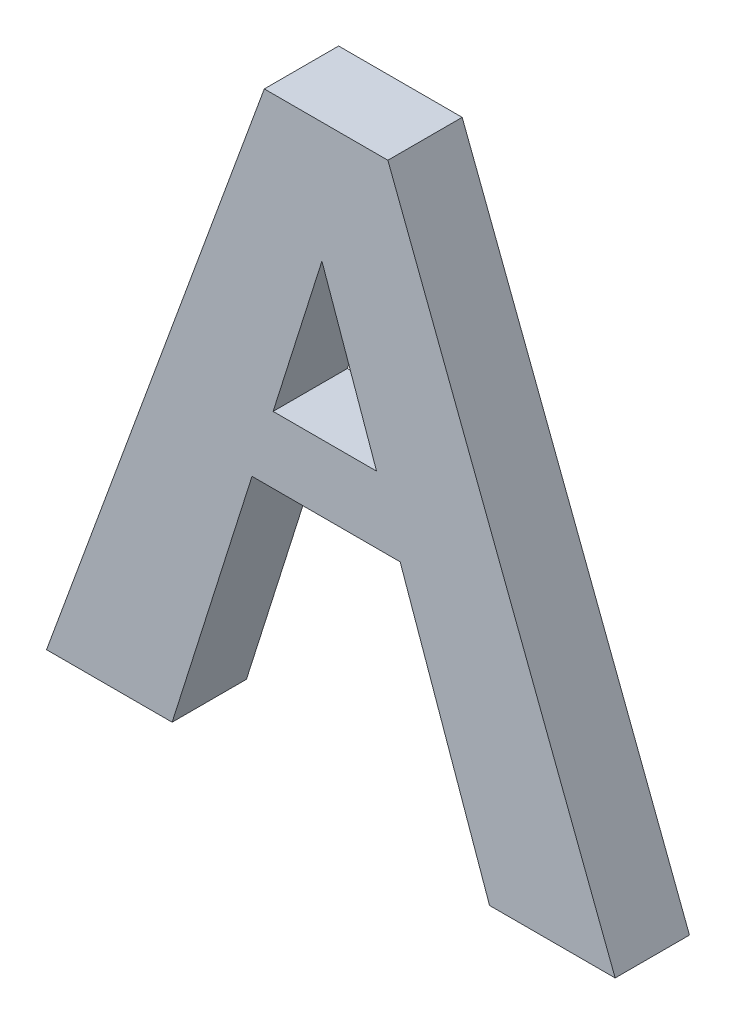
ISO-10303-21;
HEADER;
FILE_DESCRIPTION(('STEP AP214'),'2;1');
FILE_NAME('part.step','',(''),(''),'','','');
FILE_SCHEMA(('AUTOMOTIVE_DESIGN { 1 0 10303 214 1 1 1 1 }'));
ENDSEC;
DATA;
#1=APPLICATION_CONTEXT('core data for automotive mechanical design processes');
#2=APPLICATION_PROTOCOL_DEFINITION('international standard','automotive_design',2000,#1);
#3=PRODUCT_CONTEXT('',#1,'mechanical');
#4=PRODUCT('Part','Part','',(#3));
#5=PRODUCT_RELATED_PRODUCT_CATEGORY('part','',(#4));
#6=PRODUCT_DEFINITION_FORMATION('','',#4);
#7=PRODUCT_DEFINITION_CONTEXT('part definition',#1,'design');
#8=PRODUCT_DEFINITION('design','',#6,#7);
#9=PRODUCT_DEFINITION_SHAPE('','',#8);
#10=(LENGTH_UNIT() NAMED_UNIT(*) SI_UNIT(.MILLI.,.METRE.));
#11=(NAMED_UNIT(*) PLANE_ANGLE_UNIT() SI_UNIT($,.RADIAN.));
#12=(NAMED_UNIT(*) SI_UNIT($,.STERADIAN.) SOLID_ANGLE_UNIT());
#13=UNCERTAINTY_MEASURE_WITH_UNIT(LENGTH_MEASURE(1.E-05),#10,'distance_accuracy_value','');
#14=(GEOMETRIC_REPRESENTATION_CONTEXT(3) GLOBAL_UNCERTAINTY_ASSIGNED_CONTEXT((#13)) GLOBAL_UNIT_ASSIGNED_CONTEXT((#10,
#11,#12)) REPRESENTATION_CONTEXT('',''));
#15=CARTESIAN_POINT('',(0.,0.,0.));
#16=DIRECTION('',(0.,0.,1.));
#17=DIRECTION('',(1.,0.,0.));
#18=AXIS2_PLACEMENT_3D('',#15,#16,#17);
#19=CARTESIAN_POINT('',(0.,0.,3.175));
#20=DIRECTION('',(0.,0.,-1.));
#21=DIRECTION('',(-1.,0.,0.));
#22=AXIS2_PLACEMENT_3D('',#19,#20,#21);
#23=PLANE('',#22);
#24=DIRECTION('',(-0.343947535763865,-0.938988867155498,0.));
#25=VECTOR('',#24,1.);
#26=CARTESIAN_POINT('',(-23.8862602771177,-21.6091203636897,3.175));
#27=LINE('',#26,#25);
#28=CARTESIAN_POINT('',(-5.27844134766191,29.1908796363103,3.175));
#29=VERTEX_POINT('',#28);
#30=CARTESIAN_POINT('',(-23.8862602771177,-21.6091203636897,3.175));
#31=VERTEX_POINT('',#30);
#32=EDGE_CURVE('E143',#29,#31,#27,.T.);
#33=ORIENTED_EDGE('',*,*,#32,.T.);
#34=DIRECTION('',(1.,0.,0.));
#35=VECTOR('',#34,1.);
#36=CARTESIAN_POINT('',(-13.1540275383073,-21.6091203636897,3.175));
#37=LINE('',#36,#35);
#38=CARTESIAN_POINT('',(-13.1540275383073,-21.6091203636897,3.175));
#39=VERTEX_POINT('',#38);
#40=EDGE_CURVE('E146',#31,#39,#37,.T.);
#41=ORIENTED_EDGE('',*,*,#40,.T.);
#42=DIRECTION('',(0.301200548820613,0.95356081577955,0.));
#43=VECTOR('',#42,1.);
#44=CARTESIAN_POINT('',(-6.32837068940135,0.,3.175));
#45=LINE('',#44,#43);
#46=CARTESIAN_POINT('',(-6.32837068940135,0.,3.175));
#47=VERTEX_POINT('',#46);
#48=EDGE_CURVE('E149',#39,#47,#45,.T.);
#49=ORIENTED_EDGE('',*,*,#48,.T.);
#50=DIRECTION('',(1.,0.,0.));
#51=VECTOR('',#50,1.);
#52=CARTESIAN_POINT('',(6.32837068940135,0.,3.175));
#53=LINE('',#52,#51);
#54=CARTESIAN_POINT('',(6.32837068940135,0.,3.175));
#55=VERTEX_POINT('',#54);
#56=EDGE_CURVE('E151',#47,#55,#53,.T.);
#57=ORIENTED_EDGE('',*,*,#56,.T.);
#58=DIRECTION('',(0.333268471217784,-0.942831971292956,0.));
#59=VECTOR('',#58,1.);
#60=CARTESIAN_POINT('',(13.9666760579518,-21.6091203636897,3.175));
#61=LINE('',#60,#59);
#62=CARTESIAN_POINT('',(13.9666760579518,-21.6091203636897,3.175));
#63=VERTEX_POINT('',#62);
#64=EDGE_CURVE('E153',#55,#63,#61,.T.);
#65=ORIENTED_EDGE('',*,*,#64,.T.);
#66=DIRECTION('',(1.,0.,0.));
#67=VECTOR('',#66,1.);
#68=CARTESIAN_POINT('',(24.6989087967622,-21.6091203636897,3.175));
#69=LINE('',#68,#67);
#70=CARTESIAN_POINT('',(24.6989087967622,-21.6091203636897,3.175));
#71=VERTEX_POINT('',#70);
#72=EDGE_CURVE('E155',#63,#71,#69,.T.);
#73=ORIENTED_EDGE('',*,*,#72,.T.);
#74=DIRECTION('',(-0.357088345830901,0.934070614713765,0.));
#75=VECTOR('',#74,1.);
#76=CARTESIAN_POINT('',(5.27844134766191,29.1908796363103,3.175));
#77=LINE('',#76,#75);
#78=CARTESIAN_POINT('',(5.27844134766191,29.1908796363103,3.175));
#79=VERTEX_POINT('',#78);
#80=EDGE_CURVE('E157',#71,#79,#77,.T.);
#81=ORIENTED_EDGE('',*,*,#80,.T.);
#82=DIRECTION('',(-1.,0.,0.));
#83=VECTOR('',#82,1.);
#84=CARTESIAN_POINT('',(-5.27844134766191,29.1908796363103,3.175));
#85=LINE('',#84,#83);
#86=EDGE_CURVE('E159',#79,#29,#85,.T.);
#87=ORIENTED_EDGE('',*,*,#86,.T.);
#88=EDGE_LOOP('',(#33,#41,#49,#57,#65,#73,#81,#87));
#89=FACE_BOUND('',#88,.T.);
#90=DIRECTION('',(-0.301200548820613,-0.95356081577955,0.));
#91=VECTOR('',#90,1.);
#92=CARTESIAN_POINT('',(-4.52676469944436,5.70364457908036,3.175));
#93=LINE('',#92,#91);
#94=CARTESIAN_POINT('',(-0.355555483012587,18.9091373272916,3.175));
#95=VERTEX_POINT('',#94);
#96=CARTESIAN_POINT('',(-4.52676469944436,5.70364457908036,3.175));
#97=VERTEX_POINT('',#96);
#98=EDGE_CURVE('E116',#95,#97,#93,.T.);
#99=ORIENTED_EDGE('',*,*,#98,.F.);
#100=DIRECTION('',(-0.333268471217785,0.942831971292956,0.));
#101=VECTOR('',#100,1.);
#102=CARTESIAN_POINT('',(-0.355555483012587,18.9091373272916,3.175));
#103=LINE('',#102,#101);
#104=CARTESIAN_POINT('',(4.3122692343001,5.70364457908036,3.175));
#105=VERTEX_POINT('',#104);
#106=EDGE_CURVE('E133',#105,#95,#103,.T.);
#107=ORIENTED_EDGE('',*,*,#106,.F.);
#108=DIRECTION('',(1.,0.,0.));
#109=VECTOR('',#108,1.);
#110=CARTESIAN_POINT('',(4.3122692343001,5.70364457908036,3.175));
#111=LINE('',#110,#109);
#112=EDGE_CURVE('E124',#97,#105,#111,.T.);
#113=ORIENTED_EDGE('',*,*,#112,.F.);
#114=EDGE_LOOP('',(#99,#107,#113));
#115=FACE_BOUND('',#114,.T.);
#116=ADVANCED_FACE('F33',(#89,#115),#23,.F.);
#117=CARTESIAN_POINT('',(0.,0.,-3.175));
#118=DIRECTION('',(0.,0.,-1.));
#119=DIRECTION('',(-1.,0.,0.));
#120=AXIS2_PLACEMENT_3D('',#117,#118,#119);
#121=PLANE('',#120);
#122=DIRECTION('',(-0.343947535763865,-0.938988867155498,0.));
#123=VECTOR('',#122,1.);
#124=CARTESIAN_POINT('',(-23.8862602771177,-21.6091203636897,-3.175));
#125=LINE('',#124,#123);
#126=CARTESIAN_POINT('',(-5.27844134766191,29.1908796363103,-3.175));
#127=VERTEX_POINT('',#126);
#128=CARTESIAN_POINT('',(-23.8862602771177,-21.6091203636897,-3.175));
#129=VERTEX_POINT('',#128);
#130=EDGE_CURVE('E131',#127,#129,#125,.T.);
#131=ORIENTED_EDGE('',*,*,#130,.F.);
#132=DIRECTION('',(-1.,0.,0.));
#133=VECTOR('',#132,1.);
#134=CARTESIAN_POINT('',(-5.27844134766191,29.1908796363103,-3.175));
#135=LINE('',#134,#133);
#136=CARTESIAN_POINT('',(5.27844134766191,29.1908796363103,-3.175));
#137=VERTEX_POINT('',#136);
#138=EDGE_CURVE('E147',#137,#127,#135,.T.);
#139=ORIENTED_EDGE('',*,*,#138,.F.);
#140=DIRECTION('',(-0.357088345830901,0.934070614713765,0.));
#141=VECTOR('',#140,1.);
#142=CARTESIAN_POINT('',(5.27844134766191,29.1908796363103,-3.175));
#143=LINE('',#142,#141);
#144=CARTESIAN_POINT('',(24.6989087967622,-21.6091203636897,-3.175));
#145=VERTEX_POINT('',#144);
#146=EDGE_CURVE('E174',#145,#137,#143,.T.);
#147=ORIENTED_EDGE('',*,*,#146,.F.);
#148=DIRECTION('',(1.,0.,0.));
#149=VECTOR('',#148,1.);
#150=CARTESIAN_POINT('',(24.6989087967622,-21.6091203636897,-3.175));
#151=LINE('',#150,#149);
#152=CARTESIAN_POINT('',(13.9666760579518,-21.6091203636897,-3.175));
#153=VERTEX_POINT('',#152);
#154=EDGE_CURVE('E172',#153,#145,#151,.T.);
#155=ORIENTED_EDGE('',*,*,#154,.F.);
#156=DIRECTION('',(0.333268471217784,-0.942831971292956,0.));
#157=VECTOR('',#156,1.);
#158=CARTESIAN_POINT('',(13.9666760579518,-21.6091203636897,-3.175));
#159=LINE('',#158,#157);
#160=CARTESIAN_POINT('',(6.32837068940135,0.,-3.175));
#161=VERTEX_POINT('',#160);
#162=EDGE_CURVE('E170',#161,#153,#159,.T.);
#163=ORIENTED_EDGE('',*,*,#162,.F.);
#164=DIRECTION('',(1.,0.,0.));
#165=VECTOR('',#164,1.);
#166=CARTESIAN_POINT('',(6.32837068940135,0.,-3.175));
#167=LINE('',#166,#165);
#168=CARTESIAN_POINT('',(-6.32837068940135,0.,-3.175));
#169=VERTEX_POINT('',#168);
#170=EDGE_CURVE('E168',#169,#161,#167,.T.);
#171=ORIENTED_EDGE('',*,*,#170,.F.);
#172=DIRECTION('',(0.301200548820613,0.95356081577955,0.));
#173=VECTOR('',#172,1.);
#174=CARTESIAN_POINT('',(-6.32837068940135,0.,-3.175));
#175=LINE('',#174,#173);
#176=CARTESIAN_POINT('',(-13.1540275383073,-21.6091203636897,-3.175));
#177=VERTEX_POINT('',#176);
#178=EDGE_CURVE('E166',#177,#169,#175,.T.);
#179=ORIENTED_EDGE('',*,*,#178,.F.);
#180=DIRECTION('',(1.,0.,0.));
#181=VECTOR('',#180,1.);
#182=CARTESIAN_POINT('',(-13.1540275383073,-21.6091203636897,-3.175));
#183=LINE('',#182,#181);
#184=EDGE_CURVE('E164',#129,#177,#183,.T.);
#185=ORIENTED_EDGE('',*,*,#184,.F.);
#186=EDGE_LOOP('',(#131,#139,#147,#155,#163,#171,#179,#185));
#187=FACE_BOUND('',#186,.T.);
#188=DIRECTION('',(-0.333268471217785,0.942831971292956,0.));
#189=VECTOR('',#188,1.);
#190=CARTESIAN_POINT('',(-0.355555483012587,18.9091373272916,-3.175));
#191=LINE('',#190,#189);
#192=CARTESIAN_POINT('',(4.3122692343001,5.70364457908036,-3.175));
#193=VERTEX_POINT('',#192);
#194=CARTESIAN_POINT('',(-0.355555483012588,18.9091373272916,-3.175));
#195=VERTEX_POINT('',#194);
#196=EDGE_CURVE('E125',#193,#195,#191,.T.);
#197=ORIENTED_EDGE('',*,*,#196,.T.);
#198=DIRECTION('',(-0.301200548820613,-0.95356081577955,0.));
#199=VECTOR('',#198,1.);
#200=CARTESIAN_POINT('',(-4.52676469944436,5.70364457908036,-3.175));
#201=LINE('',#200,#199);
#202=CARTESIAN_POINT('',(-4.52676469944436,5.70364457908036,-3.175));
#203=VERTEX_POINT('',#202);
#204=EDGE_CURVE('E56',#195,#203,#201,.T.);
#205=ORIENTED_EDGE('',*,*,#204,.T.);
#206=DIRECTION('',(1.,0.,0.));
#207=VECTOR('',#206,1.);
#208=CARTESIAN_POINT('',(4.3122692343001,5.70364457908036,-3.175));
#209=LINE('',#208,#207);
#210=EDGE_CURVE('E130',#203,#193,#209,.T.);
#211=ORIENTED_EDGE('',*,*,#210,.T.);
#212=EDGE_LOOP('',(#197,#205,#211));
#213=FACE_BOUND('',#212,.T.);
#214=ADVANCED_FACE('F204',(#187,#213),#121,.T.);
#215=CARTESIAN_POINT('',(-23.8862602771177,-21.6091203636897,3.175));
#216=DIRECTION('',(0.938988867155498,-0.343947535763865,0.));
#217=DIRECTION('',(0.343947535763865,0.938988867155498,0.));
#218=AXIS2_PLACEMENT_3D('',#215,#216,#217);
#219=PLANE('',#218);
#220=ORIENTED_EDGE('',*,*,#130,.T.);
#221=DIRECTION('',(0.,0.,-1.));
#222=VECTOR('',#221,1.);
#223=CARTESIAN_POINT('',(-23.8862602771177,-21.6091203636897,3.175));
#224=LINE('',#223,#222);
#225=EDGE_CURVE('E11',#31,#129,#224,.T.);
#226=ORIENTED_EDGE('',*,*,#225,.F.);
#227=ORIENTED_EDGE('',*,*,#32,.F.);
#228=DIRECTION('',(0.,0.,-1.));
#229=VECTOR('',#228,1.);
#230=CARTESIAN_POINT('',(-5.27844134766191,29.1908796363103,3.175));
#231=LINE('',#230,#229);
#232=EDGE_CURVE('E161',#29,#127,#231,.T.);
#233=ORIENTED_EDGE('',*,*,#232,.T.);
#234=EDGE_LOOP('',(#220,#226,#227,#233));
#235=FACE_BOUND('',#234,.T.);
#236=ADVANCED_FACE('F35',(#235),#219,.F.);
#237=CARTESIAN_POINT('',(-13.1540275383073,-21.6091203636897,3.175));
#238=DIRECTION('',(0.,1.,0.));
#239=DIRECTION('',(0.,0.,1.));
#240=AXIS2_PLACEMENT_3D('',#237,#238,#239);
#241=PLANE('',#240);
#242=ORIENTED_EDGE('',*,*,#184,.T.);
#243=DIRECTION('',(0.,0.,-1.));
#244=VECTOR('',#243,1.);
#245=CARTESIAN_POINT('',(-13.1540275383073,-21.6091203636897,3.175));
#246=LINE('',#245,#244);
#247=EDGE_CURVE('E41',#39,#177,#246,.T.);
#248=ORIENTED_EDGE('',*,*,#247,.F.);
#249=ORIENTED_EDGE('',*,*,#40,.F.);
#250=ORIENTED_EDGE('',*,*,#225,.T.);
#251=EDGE_LOOP('',(#242,#248,#249,#250));
#252=FACE_BOUND('',#251,.T.);
#253=ADVANCED_FACE('F221',(#252),#241,.F.);
#254=CARTESIAN_POINT('',(-6.32837068940135,0.,3.175));
#255=DIRECTION('',(-0.95356081577955,0.301200548820613,0.));
#256=DIRECTION('',(-0.301200548820613,-0.95356081577955,0.));
#257=AXIS2_PLACEMENT_3D('',#254,#255,#256);
#258=PLANE('',#257);
#259=ORIENTED_EDGE('',*,*,#178,.T.);
#260=DIRECTION('',(0.,0.,-1.));
#261=VECTOR('',#260,1.);
#262=CARTESIAN_POINT('',(-6.32837068940135,0.,3.175));
#263=LINE('',#262,#261);
#264=EDGE_CURVE('E191',#47,#169,#263,.T.);
#265=ORIENTED_EDGE('',*,*,#264,.F.);
#266=ORIENTED_EDGE('',*,*,#48,.F.);
#267=ORIENTED_EDGE('',*,*,#247,.T.);
#268=EDGE_LOOP('',(#259,#265,#266,#267));
#269=FACE_BOUND('',#268,.T.);
#270=ADVANCED_FACE('F198',(#269),#258,.F.);
#271=CARTESIAN_POINT('',(6.32837068940135,0.,3.175));
#272=DIRECTION('',(0.,1.,0.));
#273=DIRECTION('',(-1.,0.,0.));
#274=AXIS2_PLACEMENT_3D('',#271,#272,#273);
#275=PLANE('',#274);
#276=ORIENTED_EDGE('',*,*,#170,.T.);
#277=DIRECTION('',(0.,0.,-1.));
#278=VECTOR('',#277,1.);
#279=CARTESIAN_POINT('',(6.32837068940135,0.,3.175));
#280=LINE('',#279,#278);
#281=EDGE_CURVE('E188',#55,#161,#280,.T.);
#282=ORIENTED_EDGE('',*,*,#281,.F.);
#283=ORIENTED_EDGE('',*,*,#56,.F.);
#284=ORIENTED_EDGE('',*,*,#264,.T.);
#285=EDGE_LOOP('',(#276,#282,#283,#284));
#286=FACE_BOUND('',#285,.T.);
#287=ADVANCED_FACE('F210',(#286),#275,.F.);
#288=CARTESIAN_POINT('',(13.9666760579518,-21.6091203636897,3.175));
#289=DIRECTION('',(0.942831971292956,0.333268471217784,0.));
#290=DIRECTION('',(-0.333268471217784,0.942831971292956,0.));
#291=AXIS2_PLACEMENT_3D('',#288,#289,#290);
#292=PLANE('',#291);
#293=ORIENTED_EDGE('',*,*,#162,.T.);
#294=DIRECTION('',(0.,0.,-1.));
#295=VECTOR('',#294,1.);
#296=CARTESIAN_POINT('',(13.9666760579518,-21.6091203636897,3.175));
#297=LINE('',#296,#295);
#298=EDGE_CURVE('E185',#63,#153,#297,.T.);
#299=ORIENTED_EDGE('',*,*,#298,.F.);
#300=ORIENTED_EDGE('',*,*,#64,.F.);
#301=ORIENTED_EDGE('',*,*,#281,.T.);
#302=EDGE_LOOP('',(#293,#299,#300,#301));
#303=FACE_BOUND('',#302,.T.);
#304=ADVANCED_FACE('F214',(#303),#292,.F.);
#305=CARTESIAN_POINT('',(24.6989087967622,-21.6091203636897,3.175));
#306=DIRECTION('',(0.,1.,0.));
#307=DIRECTION('',(-1.,0.,0.));
#308=AXIS2_PLACEMENT_3D('',#305,#306,#307);
#309=PLANE('',#308);
#310=ORIENTED_EDGE('',*,*,#154,.T.);
#311=DIRECTION('',(0.,0.,-1.));
#312=VECTOR('',#311,1.);
#313=CARTESIAN_POINT('',(24.6989087967622,-21.6091203636897,3.175));
#314=LINE('',#313,#312);
#315=EDGE_CURVE('E182',#71,#145,#314,.T.);
#316=ORIENTED_EDGE('',*,*,#315,.F.);
#317=ORIENTED_EDGE('',*,*,#72,.F.);
#318=ORIENTED_EDGE('',*,*,#298,.T.);
#319=EDGE_LOOP('',(#310,#316,#317,#318));
#320=FACE_BOUND('',#319,.T.);
#321=ADVANCED_FACE('F234',(#320),#309,.F.);
#322=CARTESIAN_POINT('',(5.27844134766191,29.1908796363103,3.175));
#323=DIRECTION('',(-0.934070614713765,-0.357088345830901,0.));
#324=DIRECTION('',(0.357088345830901,-0.934070614713765,0.));
#325=AXIS2_PLACEMENT_3D('',#322,#323,#324);
#326=PLANE('',#325);
#327=ORIENTED_EDGE('',*,*,#146,.T.);
#328=DIRECTION('',(0.,0.,-1.));
#329=VECTOR('',#328,1.);
#330=CARTESIAN_POINT('',(5.27844134766191,29.1908796363103,3.175));
#331=LINE('',#330,#329);
#332=EDGE_CURVE('E179',#79,#137,#331,.T.);
#333=ORIENTED_EDGE('',*,*,#332,.F.);
#334=ORIENTED_EDGE('',*,*,#80,.F.);
#335=ORIENTED_EDGE('',*,*,#315,.T.);
#336=EDGE_LOOP('',(#327,#333,#334,#335));
#337=FACE_BOUND('',#336,.T.);
#338=ADVANCED_FACE('F232',(#337),#326,.F.);
#339=CARTESIAN_POINT('',(-5.27844134766191,29.1908796363103,3.175));
#340=DIRECTION('',(0.,-1.,0.));
#341=DIRECTION('',(0.,0.,-1.));
#342=AXIS2_PLACEMENT_3D('',#339,#340,#341);
#343=PLANE('',#342);
#344=ORIENTED_EDGE('',*,*,#138,.T.);
#345=ORIENTED_EDGE('',*,*,#232,.F.);
#346=ORIENTED_EDGE('',*,*,#86,.F.);
#347=ORIENTED_EDGE('',*,*,#332,.T.);
#348=EDGE_LOOP('',(#344,#345,#346,#347));
#349=FACE_BOUND('',#348,.T.);
#350=ADVANCED_FACE('F227',(#349),#343,.F.);
#351=CARTESIAN_POINT('',(-4.52676469944436,5.70364457908036,3.175));
#352=DIRECTION('',(0.95356081577955,-0.301200548820613,0.));
#353=DIRECTION('',(0.301200548820613,0.95356081577955,0.));
#354=AXIS2_PLACEMENT_3D('',#351,#352,#353);
#355=PLANE('',#354);
#356=ORIENTED_EDGE('',*,*,#204,.F.);
#357=DIRECTION('',(0.,0.,-1.));
#358=VECTOR('',#357,1.);
#359=CARTESIAN_POINT('',(-0.355555483012587,18.9091373272916,3.175));
#360=LINE('',#359,#358);
#361=EDGE_CURVE('E120',#95,#195,#360,.T.);
#362=ORIENTED_EDGE('',*,*,#361,.F.);
#363=ORIENTED_EDGE('',*,*,#98,.T.);
#364=DIRECTION('',(0.,0.,-1.));
#365=VECTOR('',#364,1.);
#366=CARTESIAN_POINT('',(-4.52676469944436,5.70364457908036,3.175));
#367=LINE('',#366,#365);
#368=EDGE_CURVE('E119',#97,#203,#367,.T.);
#369=ORIENTED_EDGE('',*,*,#368,.T.);
#370=EDGE_LOOP('',(#356,#362,#363,#369));
#371=FACE_BOUND('',#370,.T.);
#372=ADVANCED_FACE('F118',(#371),#355,.T.);
#373=CARTESIAN_POINT('',(4.3122692343001,5.70364457908036,3.175));
#374=DIRECTION('',(0.,1.,0.));
#375=DIRECTION('',(0.,0.,1.));
#376=AXIS2_PLACEMENT_3D('',#373,#374,#375);
#377=PLANE('',#376);
#378=ORIENTED_EDGE('',*,*,#210,.F.);
#379=ORIENTED_EDGE('',*,*,#368,.F.);
#380=ORIENTED_EDGE('',*,*,#112,.T.);
#381=DIRECTION('',(0.,0.,-1.));
#382=VECTOR('',#381,1.);
#383=CARTESIAN_POINT('',(4.3122692343001,5.70364457908036,3.175));
#384=LINE('',#383,#382);
#385=EDGE_CURVE('E48',#105,#193,#384,.T.);
#386=ORIENTED_EDGE('',*,*,#385,.T.);
#387=EDGE_LOOP('',(#378,#379,#380,#386));
#388=FACE_BOUND('',#387,.T.);
#389=ADVANCED_FACE('F128',(#388),#377,.T.);
#390=CARTESIAN_POINT('',(-0.355555483012587,18.9091373272916,3.175));
#391=DIRECTION('',(-0.942831971292956,-0.333268471217785,0.));
#392=DIRECTION('',(0.333268471217785,-0.942831971292956,0.));
#393=AXIS2_PLACEMENT_3D('',#390,#391,#392);
#394=PLANE('',#393);
#395=ORIENTED_EDGE('',*,*,#196,.F.);
#396=ORIENTED_EDGE('',*,*,#385,.F.);
#397=ORIENTED_EDGE('',*,*,#106,.T.);
#398=ORIENTED_EDGE('',*,*,#361,.T.);
#399=EDGE_LOOP('',(#395,#396,#397,#398));
#400=FACE_BOUND('',#399,.T.);
#401=ADVANCED_FACE('F259',(#400),#394,.T.);
#402=CLOSED_SHELL('',(#116,#214,#236,#253,#270,#287,#304,#321,#338,#350,#372,#389,#401));
#403=MANIFOLD_SOLID_BREP('B2',#402);
#404=ADVANCED_BREP_SHAPE_REPRESENTATION('',(#18,#403),#14);
#405=SHAPE_DEFINITION_REPRESENTATION(#9,#404);
ENDSEC;
END-ISO-10303-21;
